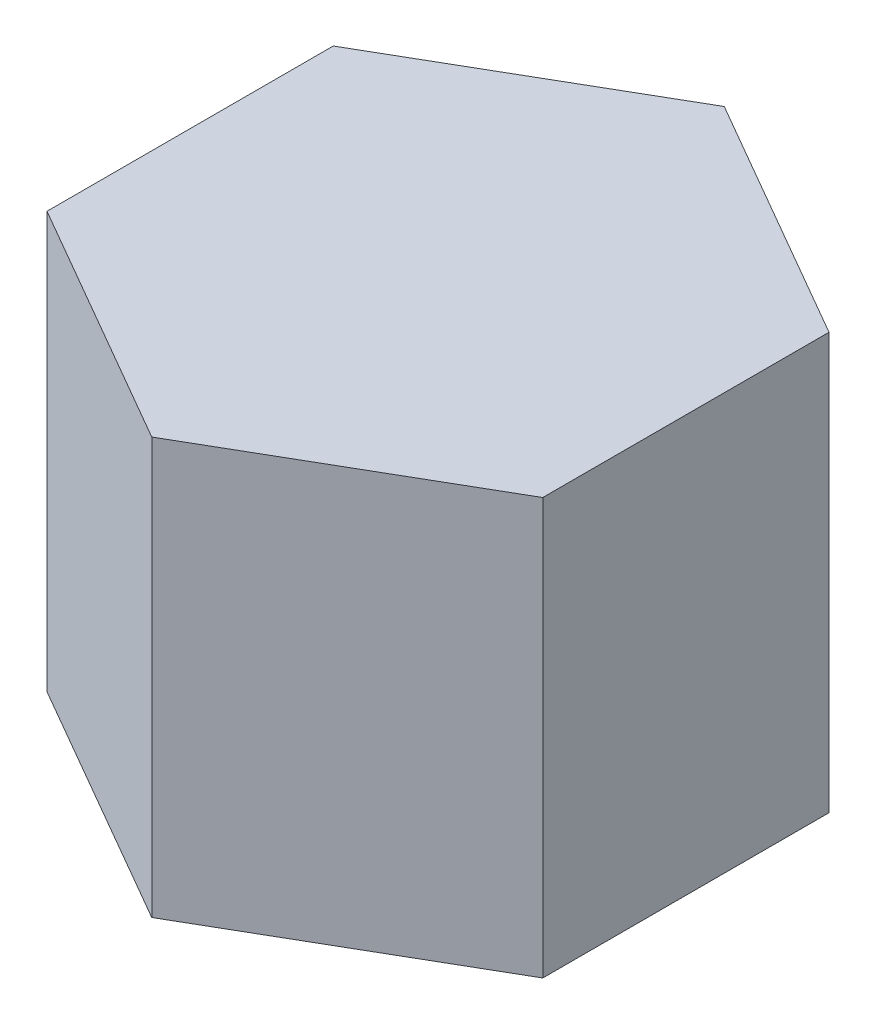
ISO-10303-21;
HEADER;
FILE_DESCRIPTION(('STEP AP214'),'2;1');
FILE_NAME('part.step','',(''),(''),'','','');
FILE_SCHEMA(('AUTOMOTIVE_DESIGN { 1 0 10303 214 1 1 1 1 }'));
ENDSEC;
DATA;
#1=APPLICATION_CONTEXT('core data for automotive mechanical design processes');
#2=APPLICATION_PROTOCOL_DEFINITION('international standard','automotive_design',2000,#1);
#3=PRODUCT_CONTEXT('',#1,'mechanical');
#4=PRODUCT('Part','Part','',(#3));
#5=PRODUCT_RELATED_PRODUCT_CATEGORY('part','',(#4));
#6=PRODUCT_DEFINITION_FORMATION('','',#4);
#7=PRODUCT_DEFINITION_CONTEXT('part definition',#1,'design');
#8=PRODUCT_DEFINITION('design','',#6,#7);
#9=PRODUCT_DEFINITION_SHAPE('','',#8);
#10=(LENGTH_UNIT() NAMED_UNIT(*) SI_UNIT(.MILLI.,.METRE.));
#11=(NAMED_UNIT(*) PLANE_ANGLE_UNIT() SI_UNIT($,.RADIAN.));
#12=(NAMED_UNIT(*) SI_UNIT($,.STERADIAN.) SOLID_ANGLE_UNIT());
#13=UNCERTAINTY_MEASURE_WITH_UNIT(LENGTH_MEASURE(1.E-05),#10,'distance_accuracy_value','');
#14=(GEOMETRIC_REPRESENTATION_CONTEXT(3) GLOBAL_UNCERTAINTY_ASSIGNED_CONTEXT((#13)) GLOBAL_UNIT_ASSIGNED_CONTEXT((#10,
#11,#12)) REPRESENTATION_CONTEXT('',''));
#15=CARTESIAN_POINT('',(0.,0.,0.));
#16=DIRECTION('',(0.,0.,1.));
#17=DIRECTION('',(1.,0.,0.));
#18=AXIS2_PLACEMENT_3D('',#15,#16,#17);
#19=CARTESIAN_POINT('',(206.839551417382,-147.556598747966,290.81594581671));
#20=DIRECTION('',(-0.500000000000062,0.,-0.866025403784403));
#21=DIRECTION('',(-0.866025403784403,0.,0.500000000000062));
#22=AXIS2_PLACEMENT_3D('',#19,#20,#21);
#23=PLANE('',#22);
#24=CARTESIAN_POINT('',(207.142660308706,-147.047793579175,290.64094581671));
#25=DIRECTION('',(-0.866025403784403,0.,0.500000000000062));
#26=VECTOR('',#25,1.);
#27=LINE('',#24,#26);
#28=CARTESIAN_POINT('',(207.142660308706,-147.047793579175,290.64094581671));
#29=VERTEX_POINT('',#28);
#30=CARTESIAN_POINT('',(206.839551417382,-147.047793579175,290.81594581671));
#31=VERTEX_POINT('',#30);
#32=EDGE_CURVE('E170',#29,#31,#27,.T.);
#33=ORIENTED_EDGE('',*,*,#32,.T.);
#34=CARTESIAN_POINT('',(206.839551417382,-147.556598747966,290.81594581671));
#35=DIRECTION('',(0.,1.,0.));
#36=VECTOR('',#35,1.);
#37=LINE('',#34,#36);
#38=CARTESIAN_POINT('',(206.839551417382,-147.556598747966,290.81594581671));
#39=VERTEX_POINT('',#38);
#40=EDGE_CURVE('E35',#39,#31,#37,.T.);
#41=ORIENTED_EDGE('',*,*,#40,.F.);
#42=CARTESIAN_POINT('',(207.142660308706,-147.556598747966,290.64094581671));
#43=DIRECTION('',(-0.866025403784403,0.,0.500000000000062));
#44=VECTOR('',#43,1.);
#45=LINE('',#42,#44);
#46=CARTESIAN_POINT('',(207.142660308706,-147.556598747966,290.64094581671));
#47=VERTEX_POINT('',#46);
#48=EDGE_CURVE('E159',#47,#39,#45,.T.);
#49=ORIENTED_EDGE('',*,*,#48,.F.);
#50=CARTESIAN_POINT('',(207.142660308706,-147.556598747966,290.64094581671));
#51=DIRECTION('',(0.,1.,0.));
#52=VECTOR('',#51,1.);
#53=LINE('',#50,#52);
#54=EDGE_CURVE('E10',#47,#29,#53,.T.);
#55=ORIENTED_EDGE('',*,*,#54,.T.);
#56=EDGE_LOOP('',(#33,#41,#49,#55));
#57=FACE_BOUND('',#56,.T.);
#58=ADVANCED_FACE('F16',(#57),#23,.F.);
#59=CARTESIAN_POINT('',(207.142660308706,-147.556598747966,291.594471220494));
#60=DIRECTION('',(-1.,0.,0.));
#61=DIRECTION('',(0.,-1.,0.));
#62=AXIS2_PLACEMENT_3D('',#59,#60,#61);
#63=PLANE('',#62);
#64=CARTESIAN_POINT('',(207.142660308706,-147.047793579175,290.29094581671));
#65=DIRECTION('',(0.,0.,1.));
#66=VECTOR('',#65,1.);
#67=LINE('',#64,#66);
#68=CARTESIAN_POINT('',(207.142660308706,-147.047793579175,290.29094581671));
#69=VERTEX_POINT('',#68);
#70=EDGE_CURVE('E167',#69,#29,#67,.T.);
#71=ORIENTED_EDGE('',*,*,#70,.T.);
#72=ORIENTED_EDGE('',*,*,#54,.F.);
#73=CARTESIAN_POINT('',(207.142660308706,-147.556598747966,290.29094581671));
#74=DIRECTION('',(0.,0.,1.));
#75=VECTOR('',#74,1.);
#76=LINE('',#73,#75);
#77=CARTESIAN_POINT('',(207.142660308706,-147.556598747966,290.29094581671));
#78=VERTEX_POINT('',#77);
#79=EDGE_CURVE('E156',#78,#47,#76,.T.);
#80=ORIENTED_EDGE('',*,*,#79,.F.);
#81=CARTESIAN_POINT('',(207.142660308706,-147.556598747966,290.29094581671));
#82=DIRECTION('',(0.,1.,0.));
#83=VECTOR('',#82,1.);
#84=LINE('',#81,#83);
#85=EDGE_CURVE('E27',#78,#69,#84,.T.);
#86=ORIENTED_EDGE('',*,*,#85,.T.);
#87=EDGE_LOOP('',(#71,#72,#80,#86));
#88=FACE_BOUND('',#87,.T.);
#89=ADVANCED_FACE('F189',(#88),#63,.F.);
#90=CARTESIAN_POINT('',(207.142660308706,-147.556598747966,290.29094581671));
#91=DIRECTION('',(-0.500000000000028,0.,0.866025403784422));
#92=DIRECTION('',(0.866025403784423,0.,0.500000000000028));
#93=AXIS2_PLACEMENT_3D('',#90,#91,#92);
#94=PLANE('',#93);
#95=CARTESIAN_POINT('',(206.839551417381,-147.047793579175,290.11594581671));
#96=DIRECTION('',(0.866025403784422,0.,0.500000000000028));
#97=VECTOR('',#96,1.);
#98=LINE('',#95,#97);
#99=CARTESIAN_POINT('',(206.839551417382,-147.047793579175,290.11594581671));
#100=VERTEX_POINT('',#99);
#101=EDGE_CURVE('E163',#100,#69,#98,.T.);
#102=ORIENTED_EDGE('',*,*,#101,.T.);
#103=ORIENTED_EDGE('',*,*,#85,.F.);
#104=CARTESIAN_POINT('',(206.839551417381,-147.556598747966,290.11594581671));
#105=DIRECTION('',(0.866025403784422,0.,0.500000000000028));
#106=VECTOR('',#105,1.);
#107=LINE('',#104,#106);
#108=CARTESIAN_POINT('',(206.839551417382,-147.556598747966,290.11594581671));
#109=VERTEX_POINT('',#108);
#110=EDGE_CURVE('E106',#109,#78,#107,.T.);
#111=ORIENTED_EDGE('',*,*,#110,.F.);
#112=CARTESIAN_POINT('',(206.839551417382,-147.556598747966,290.11594581671));
#113=DIRECTION('',(0.,1.,0.));
#114=VECTOR('',#113,1.);
#115=LINE('',#112,#114);
#116=EDGE_CURVE('E94',#109,#100,#115,.T.);
#117=ORIENTED_EDGE('',*,*,#116,.T.);
#118=EDGE_LOOP('',(#102,#103,#111,#117));
#119=FACE_BOUND('',#118,.T.);
#120=ADVANCED_FACE('F198',(#119),#94,.F.);
#121=CARTESIAN_POINT('',(206.839551417382,-147.556598747966,290.11594581671));
#122=DIRECTION('',(0.499999999999943,0.,0.866025403784471));
#123=DIRECTION('',(0.866025403784471,0.,-0.499999999999943));
#124=AXIS2_PLACEMENT_3D('',#121,#122,#123);
#125=PLANE('',#124);
#126=CARTESIAN_POINT('',(206.536442526057,-147.047793579175,290.29094581671));
#127=DIRECTION('',(0.866025403784471,0.,-0.499999999999943));
#128=VECTOR('',#127,1.);
#129=LINE('',#126,#128);
#130=CARTESIAN_POINT('',(206.536442526057,-147.047793579175,290.29094581671));
#131=VERTEX_POINT('',#130);
#132=EDGE_CURVE('E162',#131,#100,#129,.T.);
#133=ORIENTED_EDGE('',*,*,#132,.T.);
#134=ORIENTED_EDGE('',*,*,#116,.F.);
#135=CARTESIAN_POINT('',(206.536442526057,-147.556598747966,290.29094581671));
#136=DIRECTION('',(0.866025403784471,0.,-0.499999999999943));
#137=VECTOR('',#136,1.);
#138=LINE('',#135,#137);
#139=CARTESIAN_POINT('',(206.536442526057,-147.556598747966,290.29094581671));
#140=VERTEX_POINT('',#139);
#141=EDGE_CURVE('E98',#140,#109,#138,.T.);
#142=ORIENTED_EDGE('',*,*,#141,.F.);
#143=CARTESIAN_POINT('',(206.536442526057,-147.556598747966,290.29094581671));
#144=DIRECTION('',(0.,1.,0.));
#145=VECTOR('',#144,1.);
#146=LINE('',#143,#145);
#147=EDGE_CURVE('E79',#140,#131,#146,.T.);
#148=ORIENTED_EDGE('',*,*,#147,.T.);
#149=EDGE_LOOP('',(#133,#134,#142,#148));
#150=FACE_BOUND('',#149,.T.);
#151=ADVANCED_FACE('F100',(#150),#125,.F.);
#152=CARTESIAN_POINT('',(206.536442526057,-147.556598747966,291.594471220494));
#153=DIRECTION('',(1.,0.,0.));
#154=DIRECTION('',(0.,1.,0.));
#155=AXIS2_PLACEMENT_3D('',#152,#153,#154);
#156=PLANE('',#155);
#157=CARTESIAN_POINT('',(206.536442526057,-147.047793579175,290.64094581671));
#158=DIRECTION('',(0.,0.,-1.));
#159=VECTOR('',#158,1.);
#160=LINE('',#157,#159);
#161=CARTESIAN_POINT('',(206.536442526057,-147.047793579175,290.64094581671));
#162=VERTEX_POINT('',#161);
#163=EDGE_CURVE('E88',#162,#131,#160,.T.);
#164=ORIENTED_EDGE('',*,*,#163,.T.);
#165=ORIENTED_EDGE('',*,*,#147,.F.);
#166=CARTESIAN_POINT('',(206.536442526057,-147.556598747966,290.64094581671));
#167=DIRECTION('',(0.,0.,-1.));
#168=VECTOR('',#167,1.);
#169=LINE('',#166,#168);
#170=CARTESIAN_POINT('',(206.536442526057,-147.556598747966,290.64094581671));
#171=VERTEX_POINT('',#170);
#172=EDGE_CURVE('E84',#171,#140,#169,.T.);
#173=ORIENTED_EDGE('',*,*,#172,.F.);
#174=CARTESIAN_POINT('',(206.536442526057,-147.556598747966,290.64094581671));
#175=DIRECTION('',(0.,1.,0.));
#176=VECTOR('',#175,1.);
#177=LINE('',#174,#176);
#178=EDGE_CURVE('E58',#171,#162,#177,.T.);
#179=ORIENTED_EDGE('',*,*,#178,.T.);
#180=EDGE_LOOP('',(#164,#165,#173,#179));
#181=FACE_BOUND('',#180,.T.);
#182=ADVANCED_FACE('F82',(#181),#156,.F.);
#183=CARTESIAN_POINT('',(206.536442526057,-147.556598747966,290.64094581671));
#184=DIRECTION('',(0.500000000000062,0.,-0.866025403784403));
#185=DIRECTION('',(-0.866025403784403,0.,-0.500000000000062));
#186=AXIS2_PLACEMENT_3D('',#183,#184,#185);
#187=PLANE('',#186);
#188=CARTESIAN_POINT('',(206.839551417382,-147.047793579175,290.81594581671));
#189=DIRECTION('',(-0.866025403784403,0.,-0.500000000000062));
#190=VECTOR('',#189,1.);
#191=LINE('',#188,#190);
#192=EDGE_CURVE('E160',#31,#162,#191,.T.);
#193=ORIENTED_EDGE('',*,*,#192,.T.);
#194=ORIENTED_EDGE('',*,*,#178,.F.);
#195=CARTESIAN_POINT('',(206.839551417382,-147.556598747966,290.81594581671));
#196=DIRECTION('',(-0.866025403784403,0.,-0.500000000000062));
#197=VECTOR('',#196,1.);
#198=LINE('',#195,#197);
#199=EDGE_CURVE('E112',#39,#171,#198,.T.);
#200=ORIENTED_EDGE('',*,*,#199,.F.);
#201=ORIENTED_EDGE('',*,*,#40,.T.);
#202=EDGE_LOOP('',(#193,#194,#200,#201));
#203=FACE_BOUND('',#202,.T.);
#204=ADVANCED_FACE('F131',(#203),#187,.F.);
#205=CARTESIAN_POINT('',(206.491105863044,-147.556598747966,291.594471220494));
#206=DIRECTION('',(0.,1.,0.));
#207=DIRECTION('',(-1.,0.,0.));
#208=AXIS2_PLACEMENT_3D('',#205,#206,#207);
#209=PLANE('',#208);
#210=ORIENTED_EDGE('',*,*,#48,.T.);
#211=ORIENTED_EDGE('',*,*,#199,.T.);
#212=ORIENTED_EDGE('',*,*,#172,.T.);
#213=ORIENTED_EDGE('',*,*,#141,.T.);
#214=ORIENTED_EDGE('',*,*,#110,.T.);
#215=ORIENTED_EDGE('',*,*,#79,.T.);
#216=EDGE_LOOP('',(#210,#211,#212,#213,#214,#215));
#217=FACE_BOUND('',#216,.T.);
#218=ADVANCED_FACE('F111',(#217),#209,.F.);
#219=CARTESIAN_POINT('',(206.491105863044,-147.047793579175,291.594471220494));
#220=DIRECTION('',(0.,1.,0.));
#221=DIRECTION('',(-1.,0.,0.));
#222=AXIS2_PLACEMENT_3D('',#219,#220,#221);
#223=PLANE('',#222);
#224=ORIENTED_EDGE('',*,*,#32,.F.);
#225=ORIENTED_EDGE('',*,*,#70,.F.);
#226=ORIENTED_EDGE('',*,*,#101,.F.);
#227=ORIENTED_EDGE('',*,*,#132,.F.);
#228=ORIENTED_EDGE('',*,*,#163,.F.);
#229=ORIENTED_EDGE('',*,*,#192,.F.);
#230=EDGE_LOOP('',(#224,#225,#226,#227,#228,#229));
#231=FACE_BOUND('',#230,.T.);
#232=ADVANCED_FACE('F130',(#231),#223,.T.);
#233=CLOSED_SHELL('',(#58,#89,#120,#151,#182,#204,#218,#232));
#234=MANIFOLD_SOLID_BREP('B1',#233);
#235=ADVANCED_BREP_SHAPE_REPRESENTATION('',(#18,#234),#14);
#236=SHAPE_DEFINITION_REPRESENTATION(#9,#235);
ENDSEC;
END-ISO-10303-21;
